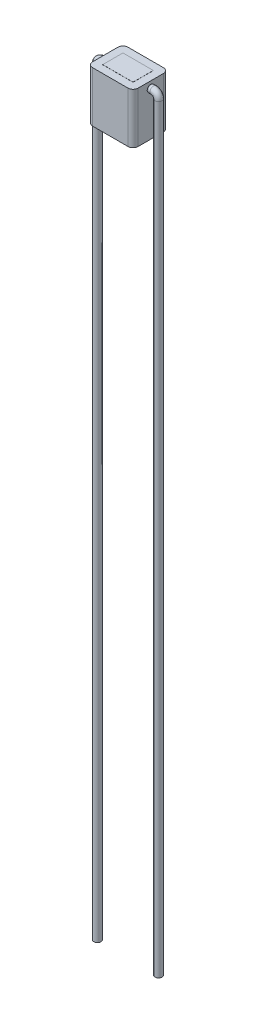
ISO-10303-21;
HEADER;
FILE_DESCRIPTION(('STEP AP214'),'2;1');
FILE_NAME('part.step','',(''),(''),'','','');
FILE_SCHEMA(('AUTOMOTIVE_DESIGN { 1 0 10303 214 1 1 1 1 }'));
ENDSEC;
DATA;
#1=APPLICATION_CONTEXT('core data for automotive mechanical design processes');
#2=APPLICATION_PROTOCOL_DEFINITION('international standard','automotive_design',2000,#1);
#3=PRODUCT_CONTEXT('',#1,'mechanical');
#4=PRODUCT('Part','Part','',(#3));
#5=PRODUCT_RELATED_PRODUCT_CATEGORY('part','',(#4));
#6=PRODUCT_DEFINITION_FORMATION('','',#4);
#7=PRODUCT_DEFINITION_CONTEXT('part definition',#1,'design');
#8=PRODUCT_DEFINITION('design','',#6,#7);
#9=PRODUCT_DEFINITION_SHAPE('','',#8);
#10=(LENGTH_UNIT() NAMED_UNIT(*) SI_UNIT(.MILLI.,.METRE.));
#11=(NAMED_UNIT(*) PLANE_ANGLE_UNIT() SI_UNIT($,.RADIAN.));
#12=(NAMED_UNIT(*) SI_UNIT($,.STERADIAN.) SOLID_ANGLE_UNIT());
#13=UNCERTAINTY_MEASURE_WITH_UNIT(LENGTH_MEASURE(1.E-05),#10,'distance_accuracy_value','');
#14=(GEOMETRIC_REPRESENTATION_CONTEXT(3) GLOBAL_UNCERTAINTY_ASSIGNED_CONTEXT((#13)) GLOBAL_UNIT_ASSIGNED_CONTEXT((#10,
#11,#12)) REPRESENTATION_CONTEXT('',''));
#15=CARTESIAN_POINT('',(0.,0.,0.));
#16=DIRECTION('',(0.,0.,1.));
#17=DIRECTION('',(1.,0.,0.));
#18=AXIS2_PLACEMENT_3D('',#15,#16,#17);
#19=CARTESIAN_POINT('',(2.25,5.,-1.75));
#20=DIRECTION('',(-1.,0.,0.));
#21=DIRECTION('',(0.,0.,1.));
#22=AXIS2_PLACEMENT_3D('',#19,#20,#21);
#23=PLANE('',#22);
#24=CARTESIAN_POINT('',(2.25,4.3537820782084,0.));
#25=DIRECTION('',(1.,0.,0.));
#26=DIRECTION('',(0.,0.,-1.));
#27=AXIS2_PLACEMENT_3D('',#24,#25,#26);
#28=CIRCLE('',#27,0.35);
#29=CARTESIAN_POINT('',(2.25,4.3537820782084,-0.35));
#30=VERTEX_POINT('',#29);
#31=EDGE_CURVE('E156',#30,#30,#28,.T.);
#32=ORIENTED_EDGE('',*,*,#31,.F.);
#33=EDGE_LOOP('',(#32));
#34=FACE_BOUND('',#33,.T.);
#35=DIRECTION('',(0.,0.,-1.));
#36=VECTOR('',#35,1.);
#37=CARTESIAN_POINT('',(2.25,5.,-1.75));
#38=LINE('',#37,#36);
#39=CARTESIAN_POINT('',(2.25,5.,1.25));
#40=VERTEX_POINT('',#39);
#41=CARTESIAN_POINT('',(2.25,5.,-1.25));
#42=VERTEX_POINT('',#41);
#43=EDGE_CURVE('E229',#40,#42,#38,.T.);
#44=ORIENTED_EDGE('',*,*,#43,.F.);
#45=DIRECTION('',(0.,-1.,0.));
#46=VECTOR('',#45,1.);
#47=CARTESIAN_POINT('',(2.25,5.,1.25));
#48=LINE('',#47,#46);
#49=CARTESIAN_POINT('',(2.25,0.,1.25));
#50=VERTEX_POINT('',#49);
#51=EDGE_CURVE('E263',#40,#50,#48,.T.);
#52=ORIENTED_EDGE('',*,*,#51,.T.);
#53=DIRECTION('',(0.,0.,-1.));
#54=VECTOR('',#53,1.);
#55=CARTESIAN_POINT('',(2.25,0.,-1.75));
#56=LINE('',#55,#54);
#57=CARTESIAN_POINT('',(2.25,0.,-1.25));
#58=VERTEX_POINT('',#57);
#59=EDGE_CURVE('E228',#50,#58,#56,.T.);
#60=ORIENTED_EDGE('',*,*,#59,.T.);
#61=DIRECTION('',(0.,-1.,0.));
#62=VECTOR('',#61,1.);
#63=CARTESIAN_POINT('',(2.25,5.,-1.25));
#64=LINE('',#63,#62);
#65=EDGE_CURVE('E261',#58,#42,#64,.F.);
#66=ORIENTED_EDGE('',*,*,#65,.T.);
#67=EDGE_LOOP('',(#44,#52,#60,#66));
#68=FACE_BOUND('',#67,.T.);
#69=ADVANCED_FACE('F34',(#34,#68),#23,.F.);
#70=CARTESIAN_POINT('',(-2.25,5.,-1.75));
#71=DIRECTION('',(0.,0.,1.));
#72=DIRECTION('',(1.,0.,0.));
#73=AXIS2_PLACEMENT_3D('',#70,#71,#72);
#74=PLANE('',#73);
#75=DIRECTION('',(-1.,0.,0.));
#76=VECTOR('',#75,1.);
#77=CARTESIAN_POINT('',(-2.25,0.,-1.75));
#78=LINE('',#77,#76);
#79=CARTESIAN_POINT('',(1.75,0.,-1.75));
#80=VERTEX_POINT('',#79);
#81=CARTESIAN_POINT('',(-1.75,0.,-1.75));
#82=VERTEX_POINT('',#81);
#83=EDGE_CURVE('E243',#80,#82,#78,.T.);
#84=ORIENTED_EDGE('',*,*,#83,.T.);
#85=DIRECTION('',(0.,-1.,0.));
#86=VECTOR('',#85,1.);
#87=CARTESIAN_POINT('',(-1.75,5.,-1.75));
#88=LINE('',#87,#86);
#89=CARTESIAN_POINT('',(-1.75,5.,-1.75));
#90=VERTEX_POINT('',#89);
#91=EDGE_CURVE('E11',#82,#90,#88,.F.);
#92=ORIENTED_EDGE('',*,*,#91,.T.);
#93=DIRECTION('',(-1.,0.,0.));
#94=VECTOR('',#93,1.);
#95=CARTESIAN_POINT('',(-2.25,5.,-1.75));
#96=LINE('',#95,#94);
#97=CARTESIAN_POINT('',(1.75,5.,-1.75));
#98=VERTEX_POINT('',#97);
#99=EDGE_CURVE('E232',#98,#90,#96,.T.);
#100=ORIENTED_EDGE('',*,*,#99,.F.);
#101=DIRECTION('',(0.,-1.,0.));
#102=VECTOR('',#101,1.);
#103=CARTESIAN_POINT('',(1.75,5.,-1.75));
#104=LINE('',#103,#102);
#105=EDGE_CURVE('E42',#98,#80,#104,.T.);
#106=ORIENTED_EDGE('',*,*,#105,.T.);
#107=EDGE_LOOP('',(#84,#92,#100,#106));
#108=FACE_BOUND('',#107,.T.);
#109=ADVANCED_FACE('F294',(#108),#74,.F.);
#110=CARTESIAN_POINT('',(-2.25,5.,-1.75));
#111=DIRECTION('',(1.,0.,0.));
#112=DIRECTION('',(0.,0.,-1.));
#113=AXIS2_PLACEMENT_3D('',#110,#111,#112);
#114=PLANE('',#113);
#115=CARTESIAN_POINT('',(-2.25,4.3537820782084,0.));
#116=DIRECTION('',(1.,0.,0.));
#117=DIRECTION('',(0.,0.,-1.));
#118=AXIS2_PLACEMENT_3D('',#115,#116,#117);
#119=CIRCLE('',#118,0.35);
#120=CARTESIAN_POINT('',(-2.25,4.3537820782084,-0.35));
#121=VERTEX_POINT('',#120);
#122=EDGE_CURVE('E644',#121,#121,#119,.F.);
#123=ORIENTED_EDGE('',*,*,#122,.F.);
#124=EDGE_LOOP('',(#123));
#125=FACE_BOUND('',#124,.T.);
#126=DIRECTION('',(0.,0.,1.));
#127=VECTOR('',#126,1.);
#128=CARTESIAN_POINT('',(-2.25,0.,-1.75));
#129=LINE('',#128,#127);
#130=CARTESIAN_POINT('',(-2.25,0.,-1.25));
#131=VERTEX_POINT('',#130);
#132=CARTESIAN_POINT('',(-2.25,0.,1.25));
#133=VERTEX_POINT('',#132);
#134=EDGE_CURVE('E246',#131,#133,#129,.T.);
#135=ORIENTED_EDGE('',*,*,#134,.T.);
#136=DIRECTION('',(0.,-1.,0.));
#137=VECTOR('',#136,1.);
#138=CARTESIAN_POINT('',(-2.25,5.,1.25));
#139=LINE('',#138,#137);
#140=CARTESIAN_POINT('',(-2.25,5.,1.25));
#141=VERTEX_POINT('',#140);
#142=EDGE_CURVE('E49',#133,#141,#139,.F.);
#143=ORIENTED_EDGE('',*,*,#142,.T.);
#144=DIRECTION('',(0.,0.,1.));
#145=VECTOR('',#144,1.);
#146=CARTESIAN_POINT('',(-2.25,5.,-1.75));
#147=LINE('',#146,#145);
#148=CARTESIAN_POINT('',(-2.25,5.,-1.25));
#149=VERTEX_POINT('',#148);
#150=EDGE_CURVE('E235',#149,#141,#147,.T.);
#151=ORIENTED_EDGE('',*,*,#150,.F.);
#152=DIRECTION('',(0.,-1.,0.));
#153=VECTOR('',#152,1.);
#154=CARTESIAN_POINT('',(-2.25,5.,-1.25));
#155=LINE('',#154,#153);
#156=EDGE_CURVE('E286',#149,#131,#155,.T.);
#157=ORIENTED_EDGE('',*,*,#156,.T.);
#158=EDGE_LOOP('',(#135,#143,#151,#157));
#159=FACE_BOUND('',#158,.T.);
#160=ADVANCED_FACE('F305',(#125,#159),#114,.F.);
#161=CARTESIAN_POINT('',(-2.25,5.,1.75));
#162=DIRECTION('',(0.,0.,-1.));
#163=DIRECTION('',(-1.,0.,0.));
#164=AXIS2_PLACEMENT_3D('',#161,#162,#163);
#165=PLANE('',#164);
#166=DIRECTION('',(1.,0.,0.));
#167=VECTOR('',#166,1.);
#168=CARTESIAN_POINT('',(-2.25,0.,1.75));
#169=LINE('',#168,#167);
#170=CARTESIAN_POINT('',(-1.75,0.,1.75));
#171=VERTEX_POINT('',#170);
#172=CARTESIAN_POINT('',(1.75,0.,1.75));
#173=VERTEX_POINT('',#172);
#174=EDGE_CURVE('E233',#171,#173,#169,.T.);
#175=ORIENTED_EDGE('',*,*,#174,.T.);
#176=DIRECTION('',(0.,-1.,0.));
#177=VECTOR('',#176,1.);
#178=CARTESIAN_POINT('',(1.75,5.,1.75));
#179=LINE('',#178,#177);
#180=CARTESIAN_POINT('',(1.75,5.,1.75));
#181=VERTEX_POINT('',#180);
#182=EDGE_CURVE('E277',#173,#181,#179,.F.);
#183=ORIENTED_EDGE('',*,*,#182,.T.);
#184=DIRECTION('',(1.,0.,0.));
#185=VECTOR('',#184,1.);
#186=CARTESIAN_POINT('',(-2.25,5.,1.75));
#187=LINE('',#186,#185);
#188=CARTESIAN_POINT('',(-1.75,5.,1.75));
#189=VERTEX_POINT('',#188);
#190=EDGE_CURVE('E237',#189,#181,#187,.T.);
#191=ORIENTED_EDGE('',*,*,#190,.F.);
#192=DIRECTION('',(0.,-1.,0.));
#193=VECTOR('',#192,1.);
#194=CARTESIAN_POINT('',(-1.75,5.,1.75));
#195=LINE('',#194,#193);
#196=EDGE_CURVE('E274',#189,#171,#195,.T.);
#197=ORIENTED_EDGE('',*,*,#196,.T.);
#198=EDGE_LOOP('',(#175,#183,#191,#197));
#199=FACE_BOUND('',#198,.T.);
#200=ADVANCED_FACE('F314',(#199),#165,.F.);
#201=CARTESIAN_POINT('',(0.,5.,0.));
#202=DIRECTION('',(0.,1.,0.));
#203=DIRECTION('',(0.,0.,1.));
#204=AXIS2_PLACEMENT_3D('',#201,#202,#203);
#205=PLANE('',#204);
#206=DIRECTION('',(0.,0.,-1.));
#207=VECTOR('',#206,1.);
#208=CARTESIAN_POINT('',(1.5,5.,0.));
#209=LINE('',#208,#207);
#210=CARTESIAN_POINT('',(1.5,5.,1.));
#211=VERTEX_POINT('',#210);
#212=CARTESIAN_POINT('',(1.5,5.,-1.));
#213=VERTEX_POINT('',#212);
#214=EDGE_CURVE('E225',#211,#213,#209,.T.);
#215=ORIENTED_EDGE('',*,*,#214,.F.);
#216=DIRECTION('',(1.,0.,0.));
#217=VECTOR('',#216,1.);
#218=CARTESIAN_POINT('',(0.,5.,1.));
#219=LINE('',#218,#217);
#220=CARTESIAN_POINT('',(-1.5,5.,1.));
#221=VERTEX_POINT('',#220);
#222=EDGE_CURVE('E222',#221,#211,#219,.T.);
#223=ORIENTED_EDGE('',*,*,#222,.F.);
#224=DIRECTION('',(0.,0.,1.));
#225=VECTOR('',#224,1.);
#226=CARTESIAN_POINT('',(-1.5,5.,0.));
#227=LINE('',#226,#225);
#228=CARTESIAN_POINT('',(-1.5,5.,-1.));
#229=VERTEX_POINT('',#228);
#230=EDGE_CURVE('E219',#229,#221,#227,.T.);
#231=ORIENTED_EDGE('',*,*,#230,.F.);
#232=DIRECTION('',(-1.,0.,0.));
#233=VECTOR('',#232,1.);
#234=CARTESIAN_POINT('',(0.,5.,-1.));
#235=LINE('',#234,#233);
#236=EDGE_CURVE('E205',#213,#229,#235,.T.);
#237=ORIENTED_EDGE('',*,*,#236,.F.);
#238=EDGE_LOOP('',(#215,#223,#231,#237));
#239=FACE_BOUND('',#238,.T.);
#240=ORIENTED_EDGE('',*,*,#190,.T.);
#241=CARTESIAN_POINT('',(1.75,5.,1.25));
#242=DIRECTION('',(0.,1.,0.));
#243=DIRECTION('',(0.,0.,1.));
#244=AXIS2_PLACEMENT_3D('',#241,#242,#243);
#245=CIRCLE('',#244,0.5);
#246=EDGE_CURVE('E284',#181,#40,#245,.T.);
#247=ORIENTED_EDGE('',*,*,#246,.T.);
#248=ORIENTED_EDGE('',*,*,#43,.T.);
#249=CARTESIAN_POINT('',(1.75,5.,-1.25));
#250=DIRECTION('',(0.,1.,0.));
#251=DIRECTION('',(0.,0.,1.));
#252=AXIS2_PLACEMENT_3D('',#249,#250,#251);
#253=CIRCLE('',#252,0.5);
#254=EDGE_CURVE('E279',#42,#98,#253,.T.);
#255=ORIENTED_EDGE('',*,*,#254,.T.);
#256=ORIENTED_EDGE('',*,*,#99,.T.);
#257=CARTESIAN_POINT('',(-1.75,5.,-1.25));
#258=DIRECTION('',(0.,1.,0.));
#259=DIRECTION('',(0.,0.,1.));
#260=AXIS2_PLACEMENT_3D('',#257,#258,#259);
#261=CIRCLE('',#260,0.5);
#262=EDGE_CURVE('E56',#90,#149,#261,.T.);
#263=ORIENTED_EDGE('',*,*,#262,.T.);
#264=ORIENTED_EDGE('',*,*,#150,.T.);
#265=CARTESIAN_POINT('',(-1.75,5.,1.25));
#266=DIRECTION('',(0.,1.,0.));
#267=DIRECTION('',(0.,0.,1.));
#268=AXIS2_PLACEMENT_3D('',#265,#266,#267);
#269=CIRCLE('',#268,0.5);
#270=EDGE_CURVE('E282',#141,#189,#269,.T.);
#271=ORIENTED_EDGE('',*,*,#270,.T.);
#272=EDGE_LOOP('',(#240,#247,#248,#255,#256,#263,#264,#271));
#273=FACE_BOUND('',#272,.T.);
#274=ADVANCED_FACE('F307',(#239,#273),#205,.T.);
#275=CARTESIAN_POINT('',(0.,0.,0.));
#276=DIRECTION('',(0.,1.,0.));
#277=DIRECTION('',(0.,0.,1.));
#278=AXIS2_PLACEMENT_3D('',#275,#276,#277);
#279=PLANE('',#278);
#280=DIRECTION('',(1.,0.,0.));
#281=VECTOR('',#280,1.);
#282=CARTESIAN_POINT('',(0.,0.,1.));
#283=LINE('',#282,#281);
#284=CARTESIAN_POINT('',(-1.5,0.,1.));
#285=VERTEX_POINT('',#284);
#286=CARTESIAN_POINT('',(1.5,0.,1.));
#287=VERTEX_POINT('',#286);
#288=EDGE_CURVE('E255',#285,#287,#283,.T.);
#289=ORIENTED_EDGE('',*,*,#288,.T.);
#290=DIRECTION('',(0.,0.,-1.));
#291=VECTOR('',#290,1.);
#292=CARTESIAN_POINT('',(1.5,0.,0.));
#293=LINE('',#292,#291);
#294=CARTESIAN_POINT('',(1.5,0.,-1.));
#295=VERTEX_POINT('',#294);
#296=EDGE_CURVE('E258',#287,#295,#293,.T.);
#297=ORIENTED_EDGE('',*,*,#296,.T.);
#298=DIRECTION('',(-1.,0.,0.));
#299=VECTOR('',#298,1.);
#300=CARTESIAN_POINT('',(0.,0.,-1.));
#301=LINE('',#300,#299);
#302=CARTESIAN_POINT('',(-1.5,0.,-1.));
#303=VERTEX_POINT('',#302);
#304=EDGE_CURVE('E240',#295,#303,#301,.T.);
#305=ORIENTED_EDGE('',*,*,#304,.T.);
#306=DIRECTION('',(0.,0.,1.));
#307=VECTOR('',#306,1.);
#308=CARTESIAN_POINT('',(-1.5,0.,0.));
#309=LINE('',#308,#307);
#310=EDGE_CURVE('E252',#303,#285,#309,.T.);
#311=ORIENTED_EDGE('',*,*,#310,.T.);
#312=EDGE_LOOP('',(#289,#297,#305,#311));
#313=FACE_BOUND('',#312,.T.);
#314=ORIENTED_EDGE('',*,*,#59,.F.);
#315=CARTESIAN_POINT('',(1.75,0.,1.25));
#316=DIRECTION('',(0.,1.,0.));
#317=DIRECTION('',(0.,0.,1.));
#318=AXIS2_PLACEMENT_3D('',#315,#316,#317);
#319=CIRCLE('',#318,0.5);
#320=EDGE_CURVE('E272',#50,#173,#319,.F.);
#321=ORIENTED_EDGE('',*,*,#320,.T.);
#322=ORIENTED_EDGE('',*,*,#174,.F.);
#323=CARTESIAN_POINT('',(-1.75,0.,1.25));
#324=DIRECTION('',(0.,1.,0.));
#325=DIRECTION('',(0.,0.,1.));
#326=AXIS2_PLACEMENT_3D('',#323,#324,#325);
#327=CIRCLE('',#326,0.5);
#328=EDGE_CURVE('E270',#171,#133,#327,.F.);
#329=ORIENTED_EDGE('',*,*,#328,.T.);
#330=ORIENTED_EDGE('',*,*,#134,.F.);
#331=CARTESIAN_POINT('',(-1.75,0.,-1.25));
#332=DIRECTION('',(0.,1.,0.));
#333=DIRECTION('',(0.,0.,1.));
#334=AXIS2_PLACEMENT_3D('',#331,#332,#333);
#335=CIRCLE('',#334,0.5);
#336=EDGE_CURVE('E268',#131,#82,#335,.F.);
#337=ORIENTED_EDGE('',*,*,#336,.T.);
#338=ORIENTED_EDGE('',*,*,#83,.F.);
#339=CARTESIAN_POINT('',(1.75,0.,-1.25));
#340=DIRECTION('',(0.,1.,0.));
#341=DIRECTION('',(0.,0.,1.));
#342=AXIS2_PLACEMENT_3D('',#339,#340,#341);
#343=CIRCLE('',#342,0.5);
#344=EDGE_CURVE('E266',#80,#58,#343,.F.);
#345=ORIENTED_EDGE('',*,*,#344,.T.);
#346=EDGE_LOOP('',(#314,#321,#322,#329,#330,#337,#338,#345));
#347=FACE_BOUND('',#346,.T.);
#348=ADVANCED_FACE('F300',(#313,#347),#279,.F.);
#349=CARTESIAN_POINT('',(0.,-0.01,0.));
#350=DIRECTION('',(0.,1.,0.));
#351=DIRECTION('',(0.,0.,1.));
#352=AXIS2_PLACEMENT_3D('',#349,#350,#351);
#353=PLANE('',#352);
#354=DIRECTION('',(0.,0.,-1.));
#355=VECTOR('',#354,1.);
#356=CARTESIAN_POINT('',(1.5,-0.01,-1.));
#357=LINE('',#356,#355);
#358=CARTESIAN_POINT('',(1.5,-0.01,1.));
#359=VERTEX_POINT('',#358);
#360=CARTESIAN_POINT('',(1.5,-0.01,-1.));
#361=VERTEX_POINT('',#360);
#362=EDGE_CURVE('E189',#359,#361,#357,.T.);
#363=ORIENTED_EDGE('',*,*,#362,.F.);
#364=DIRECTION('',(1.,0.,0.));
#365=VECTOR('',#364,1.);
#366=CARTESIAN_POINT('',(-1.5,-0.01,1.));
#367=LINE('',#366,#365);
#368=CARTESIAN_POINT('',(-1.5,-0.01,1.));
#369=VERTEX_POINT('',#368);
#370=EDGE_CURVE('E198',#369,#359,#367,.T.);
#371=ORIENTED_EDGE('',*,*,#370,.F.);
#372=DIRECTION('',(0.,0.,1.));
#373=VECTOR('',#372,1.);
#374=CARTESIAN_POINT('',(-1.5,-0.01,-1.));
#375=LINE('',#374,#373);
#376=CARTESIAN_POINT('',(-1.5,-0.01,-1.));
#377=VERTEX_POINT('',#376);
#378=EDGE_CURVE('E195',#377,#369,#375,.T.);
#379=ORIENTED_EDGE('',*,*,#378,.F.);
#380=DIRECTION('',(-1.,0.,0.));
#381=VECTOR('',#380,1.);
#382=CARTESIAN_POINT('',(-1.5,-0.01,-1.));
#383=LINE('',#382,#381);
#384=EDGE_CURVE('E192',#361,#377,#383,.T.);
#385=ORIENTED_EDGE('',*,*,#384,.F.);
#386=EDGE_LOOP('',(#363,#371,#379,#385));
#387=FACE_BOUND('',#386,.T.);
#388=ADVANCED_FACE('F488',(#387),#353,.F.);
#389=CARTESIAN_POINT('',(-1.5,-0.01,-1.));
#390=DIRECTION('',(0.,0.,-1.));
#391=DIRECTION('',(-1.,0.,0.));
#392=AXIS2_PLACEMENT_3D('',#389,#390,#391);
#393=PLANE('',#392);
#394=ORIENTED_EDGE('',*,*,#304,.F.);
#395=DIRECTION('',(0.,1.,0.));
#396=VECTOR('',#395,1.);
#397=CARTESIAN_POINT('',(1.5,-0.01,-1.));
#398=LINE('',#397,#396);
#399=EDGE_CURVE('E214',#361,#295,#398,.T.);
#400=ORIENTED_EDGE('',*,*,#399,.F.);
#401=ORIENTED_EDGE('',*,*,#384,.T.);
#402=DIRECTION('',(0.,1.,0.));
#403=VECTOR('',#402,1.);
#404=CARTESIAN_POINT('',(-1.5,-0.01,-1.));
#405=LINE('',#404,#403);
#406=EDGE_CURVE('E211',#377,#303,#405,.T.);
#407=ORIENTED_EDGE('',*,*,#406,.T.);
#408=EDGE_LOOP('',(#394,#400,#401,#407));
#409=FACE_BOUND('',#408,.T.);
#410=ADVANCED_FACE('F491',(#409),#393,.T.);
#411=CARTESIAN_POINT('',(-1.5,-0.01,-1.));
#412=DIRECTION('',(-1.,0.,0.));
#413=DIRECTION('',(0.,0.,1.));
#414=AXIS2_PLACEMENT_3D('',#411,#412,#413);
#415=PLANE('',#414);
#416=ORIENTED_EDGE('',*,*,#310,.F.);
#417=ORIENTED_EDGE('',*,*,#406,.F.);
#418=ORIENTED_EDGE('',*,*,#378,.T.);
#419=DIRECTION('',(0.,1.,0.));
#420=VECTOR('',#419,1.);
#421=CARTESIAN_POINT('',(-1.5,-0.01,1.));
#422=LINE('',#421,#420);
#423=EDGE_CURVE('E207',#369,#285,#422,.T.);
#424=ORIENTED_EDGE('',*,*,#423,.T.);
#425=EDGE_LOOP('',(#416,#417,#418,#424));
#426=FACE_BOUND('',#425,.T.);
#427=ADVANCED_FACE('F503',(#426),#415,.T.);
#428=CARTESIAN_POINT('',(-1.5,-0.01,1.));
#429=DIRECTION('',(0.,0.,1.));
#430=DIRECTION('',(1.,0.,0.));
#431=AXIS2_PLACEMENT_3D('',#428,#429,#430);
#432=PLANE('',#431);
#433=ORIENTED_EDGE('',*,*,#288,.F.);
#434=ORIENTED_EDGE('',*,*,#423,.F.);
#435=ORIENTED_EDGE('',*,*,#370,.T.);
#436=DIRECTION('',(0.,1.,0.));
#437=VECTOR('',#436,1.);
#438=CARTESIAN_POINT('',(1.5,-0.01,1.));
#439=LINE('',#438,#437);
#440=EDGE_CURVE('E202',#359,#287,#439,.T.);
#441=ORIENTED_EDGE('',*,*,#440,.T.);
#442=EDGE_LOOP('',(#433,#434,#435,#441));
#443=FACE_BOUND('',#442,.T.);
#444=ADVANCED_FACE('F499',(#443),#432,.T.);
#445=CARTESIAN_POINT('',(1.5,-0.01,-1.));
#446=DIRECTION('',(1.,0.,0.));
#447=DIRECTION('',(0.,0.,-1.));
#448=AXIS2_PLACEMENT_3D('',#445,#446,#447);
#449=PLANE('',#448);
#450=ORIENTED_EDGE('',*,*,#296,.F.);
#451=ORIENTED_EDGE('',*,*,#440,.F.);
#452=ORIENTED_EDGE('',*,*,#362,.T.);
#453=ORIENTED_EDGE('',*,*,#399,.T.);
#454=EDGE_LOOP('',(#450,#451,#452,#453));
#455=FACE_BOUND('',#454,.T.);
#456=ADVANCED_FACE('F509',(#455),#449,.T.);
#457=CARTESIAN_POINT('',(1.5,5.01,1.));
#458=VERTEX_POINT('',#457);
#459=EDGE_CURVE('E206',#211,#458,#439,.T.);
#460=ORIENTED_EDGE('',*,*,#459,.F.);
#461=ORIENTED_EDGE('',*,*,#214,.T.);
#462=CARTESIAN_POINT('',(1.5,5.01,-1.));
#463=VERTEX_POINT('',#462);
#464=EDGE_CURVE('E201',#213,#463,#398,.T.);
#465=ORIENTED_EDGE('',*,*,#464,.T.);
#466=DIRECTION('',(0.,0.,-1.));
#467=VECTOR('',#466,1.);
#468=CARTESIAN_POINT('',(1.5,5.01,-1.));
#469=LINE('',#468,#467);
#470=EDGE_CURVE('E177',#458,#463,#469,.T.);
#471=ORIENTED_EDGE('',*,*,#470,.F.);
#472=EDGE_LOOP('',(#460,#461,#465,#471));
#473=FACE_BOUND('',#472,.T.);
#474=ADVANCED_FACE('F497',(#473),#449,.T.);
#475=CARTESIAN_POINT('',(-1.5,5.01,1.));
#476=VERTEX_POINT('',#475);
#477=EDGE_CURVE('E210',#221,#476,#422,.T.);
#478=ORIENTED_EDGE('',*,*,#477,.F.);
#479=ORIENTED_EDGE('',*,*,#222,.T.);
#480=ORIENTED_EDGE('',*,*,#459,.T.);
#481=DIRECTION('',(1.,0.,0.));
#482=VECTOR('',#481,1.);
#483=CARTESIAN_POINT('',(-1.5,5.01,1.));
#484=LINE('',#483,#482);
#485=EDGE_CURVE('E186',#476,#458,#484,.T.);
#486=ORIENTED_EDGE('',*,*,#485,.F.);
#487=EDGE_LOOP('',(#478,#479,#480,#486));
#488=FACE_BOUND('',#487,.T.);
#489=ADVANCED_FACE('F493',(#488),#432,.T.);
#490=CARTESIAN_POINT('',(-1.5,5.01,-1.));
#491=VERTEX_POINT('',#490);
#492=EDGE_CURVE('E213',#229,#491,#405,.T.);
#493=ORIENTED_EDGE('',*,*,#492,.F.);
#494=ORIENTED_EDGE('',*,*,#230,.T.);
#495=ORIENTED_EDGE('',*,*,#477,.T.);
#496=DIRECTION('',(0.,0.,1.));
#497=VECTOR('',#496,1.);
#498=CARTESIAN_POINT('',(-1.5,5.01,-1.));
#499=LINE('',#498,#497);
#500=EDGE_CURVE('E183',#491,#476,#499,.T.);
#501=ORIENTED_EDGE('',*,*,#500,.F.);
#502=EDGE_LOOP('',(#493,#494,#495,#501));
#503=FACE_BOUND('',#502,.T.);
#504=ADVANCED_FACE('F496',(#503),#415,.T.);
#505=ORIENTED_EDGE('',*,*,#464,.F.);
#506=ORIENTED_EDGE('',*,*,#236,.T.);
#507=ORIENTED_EDGE('',*,*,#492,.T.);
#508=DIRECTION('',(-1.,0.,0.));
#509=VECTOR('',#508,1.);
#510=CARTESIAN_POINT('',(-1.5,5.01,-1.));
#511=LINE('',#510,#509);
#512=EDGE_CURVE('E180',#463,#491,#511,.T.);
#513=ORIENTED_EDGE('',*,*,#512,.F.);
#514=EDGE_LOOP('',(#505,#506,#507,#513));
#515=FACE_BOUND('',#514,.T.);
#516=ADVANCED_FACE('F486',(#515),#393,.T.);
#517=CARTESIAN_POINT('',(0.,5.01,0.));
#518=DIRECTION('',(0.,1.,0.));
#519=DIRECTION('',(0.,0.,1.));
#520=AXIS2_PLACEMENT_3D('',#517,#518,#519);
#521=PLANE('',#520);
#522=ORIENTED_EDGE('',*,*,#470,.T.);
#523=ORIENTED_EDGE('',*,*,#512,.T.);
#524=ORIENTED_EDGE('',*,*,#500,.T.);
#525=ORIENTED_EDGE('',*,*,#485,.T.);
#526=EDGE_LOOP('',(#522,#523,#524,#525));
#527=FACE_BOUND('',#526,.T.);
#528=ADVANCED_FACE('F350',(#527),#521,.T.);
#529=CARTESIAN_POINT('',(1.75,5.,1.25));
#530=DIRECTION('',(0.,-1.,0.));
#531=DIRECTION('',(0.,0.,-1.));
#532=AXIS2_PLACEMENT_3D('',#529,#530,#531);
#533=CYLINDRICAL_SURFACE('',#532,0.5);
#534=ORIENTED_EDGE('',*,*,#246,.F.);
#535=ORIENTED_EDGE('',*,*,#182,.F.);
#536=ORIENTED_EDGE('',*,*,#320,.F.);
#537=ORIENTED_EDGE('',*,*,#51,.F.);
#538=EDGE_LOOP('',(#534,#535,#536,#537));
#539=FACE_BOUND('',#538,.T.);
#540=ADVANCED_FACE('F319',(#539),#533,.T.);
#541=CARTESIAN_POINT('',(-1.75,5.,1.25));
#542=DIRECTION('',(0.,-1.,0.));
#543=DIRECTION('',(0.,0.,-1.));
#544=AXIS2_PLACEMENT_3D('',#541,#542,#543);
#545=CYLINDRICAL_SURFACE('',#544,0.5);
#546=ORIENTED_EDGE('',*,*,#270,.F.);
#547=ORIENTED_EDGE('',*,*,#142,.F.);
#548=ORIENTED_EDGE('',*,*,#328,.F.);
#549=ORIENTED_EDGE('',*,*,#196,.F.);
#550=EDGE_LOOP('',(#546,#547,#548,#549));
#551=FACE_BOUND('',#550,.T.);
#552=ADVANCED_FACE('F311',(#551),#545,.T.);
#553=CARTESIAN_POINT('',(-1.75,5.,-1.25));
#554=DIRECTION('',(0.,-1.,0.));
#555=DIRECTION('',(0.,0.,-1.));
#556=AXIS2_PLACEMENT_3D('',#553,#554,#555);
#557=CYLINDRICAL_SURFACE('',#556,0.5);
#558=ORIENTED_EDGE('',*,*,#262,.F.);
#559=ORIENTED_EDGE('',*,*,#91,.F.);
#560=ORIENTED_EDGE('',*,*,#336,.F.);
#561=ORIENTED_EDGE('',*,*,#156,.F.);
#562=EDGE_LOOP('',(#558,#559,#560,#561));
#563=FACE_BOUND('',#562,.T.);
#564=ADVANCED_FACE('F304',(#563),#557,.T.);
#565=CARTESIAN_POINT('',(1.75,5.,-1.25));
#566=DIRECTION('',(0.,-1.,0.));
#567=DIRECTION('',(0.,0.,-1.));
#568=AXIS2_PLACEMENT_3D('',#565,#566,#567);
#569=CYLINDRICAL_SURFACE('',#568,0.5);
#570=ORIENTED_EDGE('',*,*,#254,.F.);
#571=ORIENTED_EDGE('',*,*,#65,.F.);
#572=ORIENTED_EDGE('',*,*,#344,.F.);
#573=ORIENTED_EDGE('',*,*,#105,.F.);
#574=EDGE_LOOP('',(#570,#571,#572,#573));
#575=FACE_BOUND('',#574,.T.);
#576=ADVANCED_FACE('F36',(#575),#569,.T.);
#577=CARTESIAN_POINT('',(3.02591837528372,-71.1462179217916,0.));
#578=DIRECTION('',(0.,-1.,0.));
#579=DIRECTION('',(0.,0.,-1.));
#580=AXIS2_PLACEMENT_3D('',#577,#578,#579);
#581=PLANE('',#580);
#582=CARTESIAN_POINT('',(3.02591837528372,-71.1462179217916,0.));
#583=DIRECTION('',(0.,-1.,0.));
#584=DIRECTION('',(0.,0.,-1.));
#585=AXIS2_PLACEMENT_3D('',#582,#583,#584);
#586=CIRCLE('',#585,0.35);
#587=CARTESIAN_POINT('',(3.02591837528372,-71.1462179217916,-0.35));
#588=VERTEX_POINT('',#587);
#589=EDGE_CURVE('E175',#588,#588,#586,.T.);
#590=ORIENTED_EDGE('',*,*,#589,.T.);
#591=EDGE_LOOP('',(#590));
#592=FACE_BOUND('',#591,.T.);
#593=ADVANCED_FACE('F324',(#592),#581,.T.);
#594=CARTESIAN_POINT('',(2.25,4.3537820782084,0.));
#595=DIRECTION('',(1.,0.,0.));
#596=DIRECTION('',(0.,0.,-1.));
#597=AXIS2_PLACEMENT_3D('',#594,#595,#596);
#598=CYLINDRICAL_SURFACE('',#597,0.35);
#599=CARTESIAN_POINT('',(2.3,4.3537820782084,0.));
#600=DIRECTION('',(1.,0.,0.));
#601=DIRECTION('',(0.,0.,-1.));
#602=AXIS2_PLACEMENT_3D('',#599,#600,#601);
#603=CIRCLE('',#602,0.35);
#604=CARTESIAN_POINT('',(2.3,4.3537820782084,-0.35));
#605=VERTEX_POINT('',#604);
#606=EDGE_CURVE('E160',#605,#605,#603,.T.);
#607=ORIENTED_EDGE('',*,*,#606,.F.);
#608=EDGE_LOOP('',(#607));
#609=FACE_BOUND('',#608,.T.);
#610=ORIENTED_EDGE('',*,*,#31,.T.);
#611=EDGE_LOOP('',(#610));
#612=FACE_BOUND('',#611,.T.);
#613=ADVANCED_FACE('F330',(#609,#612),#598,.T.);
#614=CARTESIAN_POINT('',(2.3,4.3537820782084,0.));
#615=DIRECTION('',(1.,0.,0.));
#616=DIRECTION('',(0.,0.,-1.));
#617=AXIS2_PLACEMENT_3D('',#614,#615,#616);
#618=CYLINDRICAL_SURFACE('',#617,0.35);
#619=CARTESIAN_POINT('',(2.52591837528371,4.3537820782084,0.));
#620=DIRECTION('',(1.,0.,0.));
#621=DIRECTION('',(0.,0.,-1.));
#622=AXIS2_PLACEMENT_3D('',#619,#620,#621);
#623=CIRCLE('',#622,0.35);
#624=CARTESIAN_POINT('',(2.52591837528371,4.70378207820839,0.));
#625=VERTEX_POINT('',#624);
#626=EDGE_CURVE('E169',#625,#625,#623,.T.);
#627=ORIENTED_EDGE('',*,*,#626,.F.);
#628=EDGE_LOOP('',(#627));
#629=FACE_BOUND('',#628,.T.);
#630=ORIENTED_EDGE('',*,*,#606,.T.);
#631=EDGE_LOOP('',(#630));
#632=FACE_BOUND('',#631,.T.);
#633=ADVANCED_FACE('F386',(#629,#632),#618,.T.);
#634=CARTESIAN_POINT('',(2.52591837528371,3.8537820782084,0.));
#635=DIRECTION('',(0.,0.,-1.));
#636=DIRECTION('',(-1.,0.,0.));
#637=AXIS2_PLACEMENT_3D('',#634,#635,#636);
#638=TOROIDAL_SURFACE('',#637,0.5,0.35);
#639=CARTESIAN_POINT('',(3.02591837528371,3.8537820782084,0.));
#640=DIRECTION('',(0.,-1.,0.));
#641=DIRECTION('',(0.,0.,-1.));
#642=AXIS2_PLACEMENT_3D('',#639,#640,#641);
#643=CIRCLE('',#642,0.35);
#644=CARTESIAN_POINT('',(3.37591837528371,3.8537820782084,0.));
#645=VERTEX_POINT('',#644);
#646=EDGE_CURVE('E172',#645,#645,#643,.T.);
#647=CARTESIAN_POINT('',(2.52591837528371,3.8537820782084,0.));
#648=DIRECTION('',(0.,0.,-1.));
#649=DIRECTION('',(-1.,0.,0.));
#650=AXIS2_PLACEMENT_3D('',#647,#648,#649);
#651=CIRCLE('',#650,0.85);
#652=EDGE_CURVE('',#625,#645,#651,.T.);
#653=ORIENTED_EDGE('',*,*,#626,.T.);
#654=ORIENTED_EDGE('',*,*,#646,.F.);
#655=ORIENTED_EDGE('',*,*,#652,.T.);
#656=ORIENTED_EDGE('',*,*,#652,.F.);
#657=EDGE_LOOP('',(#653,#655,#654,#656));
#658=FACE_BOUND('',#657,.T.);
#659=ADVANCED_FACE('F335',(#658),#638,.T.);
#660=CARTESIAN_POINT('',(3.02591837528371,3.8537820782084,0.));
#661=DIRECTION('',(0.,-1.,0.));
#662=DIRECTION('',(1.,0.,0.));
#663=AXIS2_PLACEMENT_3D('',#660,#661,#662);
#664=CYLINDRICAL_SURFACE('',#663,0.35);
#665=ORIENTED_EDGE('',*,*,#589,.F.);
#666=EDGE_LOOP('',(#665));
#667=FACE_BOUND('',#666,.T.);
#668=ORIENTED_EDGE('',*,*,#646,.T.);
#669=EDGE_LOOP('',(#668));
#670=FACE_BOUND('',#669,.T.);
#671=ADVANCED_FACE('F325',(#667,#670),#664,.T.);
#672=CARTESIAN_POINT('',(-3.02591837528372,-71.1462179217916,0.));
#673=DIRECTION('',(0.,-1.,0.));
#674=DIRECTION('',(0.,0.,-1.));
#675=AXIS2_PLACEMENT_3D('',#672,#673,#674);
#676=PLANE('',#675);
#677=CARTESIAN_POINT('',(-3.02591837528372,-71.1462179217916,0.));
#678=DIRECTION('',(0.,1.,0.));
#679=DIRECTION('',(0.,0.,-1.));
#680=AXIS2_PLACEMENT_3D('',#677,#678,#679);
#681=CIRCLE('',#680,0.35);
#682=CARTESIAN_POINT('',(-3.02591837528372,-71.1462179217916,-0.35));
#683=VERTEX_POINT('',#682);
#684=EDGE_CURVE('E153',#683,#683,#681,.F.);
#685=ORIENTED_EDGE('',*,*,#684,.T.);
#686=EDGE_LOOP('',(#685));
#687=FACE_BOUND('',#686,.T.);
#688=ADVANCED_FACE('F154',(#687),#676,.T.);
#689=CARTESIAN_POINT('',(-2.25,4.3537820782084,0.));
#690=DIRECTION('',(-1.,0.,0.));
#691=DIRECTION('',(0.,0.,1.));
#692=AXIS2_PLACEMENT_3D('',#689,#690,#691);
#693=CYLINDRICAL_SURFACE('',#692,0.35);
#694=CARTESIAN_POINT('',(-2.3,4.3537820782084,0.));
#695=DIRECTION('',(1.,0.,0.));
#696=DIRECTION('',(0.,0.,-1.));
#697=AXIS2_PLACEMENT_3D('',#694,#695,#696);
#698=CIRCLE('',#697,0.35);
#699=CARTESIAN_POINT('',(-2.3,4.3537820782084,-0.35));
#700=VERTEX_POINT('',#699);
#701=EDGE_CURVE('E642',#700,#700,#698,.F.);
#702=ORIENTED_EDGE('',*,*,#701,.F.);
#703=EDGE_LOOP('',(#702));
#704=FACE_BOUND('',#703,.T.);
#705=ORIENTED_EDGE('',*,*,#122,.T.);
#706=EDGE_LOOP('',(#705));
#707=FACE_BOUND('',#706,.T.);
#708=ADVANCED_FACE('F434',(#704,#707),#693,.T.);
#709=CARTESIAN_POINT('',(-2.3,4.3537820782084,0.));
#710=DIRECTION('',(-1.,0.,0.));
#711=DIRECTION('',(0.,0.,1.));
#712=AXIS2_PLACEMENT_3D('',#709,#710,#711);
#713=CYLINDRICAL_SURFACE('',#712,0.35);
#714=CARTESIAN_POINT('',(-2.52591837528371,4.3537820782084,0.));
#715=DIRECTION('',(1.,0.,0.));
#716=DIRECTION('',(0.,0.,-1.));
#717=AXIS2_PLACEMENT_3D('',#714,#715,#716);
#718=CIRCLE('',#717,0.35);
#719=CARTESIAN_POINT('',(-2.52591837528371,4.70378207820839,0.));
#720=VERTEX_POINT('',#719);
#721=EDGE_CURVE('E163',#720,#720,#718,.F.);
#722=ORIENTED_EDGE('',*,*,#721,.F.);
#723=EDGE_LOOP('',(#722));
#724=FACE_BOUND('',#723,.T.);
#725=ORIENTED_EDGE('',*,*,#701,.T.);
#726=EDGE_LOOP('',(#725));
#727=FACE_BOUND('',#726,.T.);
#728=ADVANCED_FACE('F444',(#724,#727),#713,.T.);
#729=CARTESIAN_POINT('',(-2.52591837528371,3.8537820782084,0.));
#730=DIRECTION('',(0.,0.,1.));
#731=DIRECTION('',(1.,0.,0.));
#732=AXIS2_PLACEMENT_3D('',#729,#730,#731);
#733=TOROIDAL_SURFACE('',#732,0.5,0.35);
#734=CARTESIAN_POINT('',(-3.02591837528371,3.8537820782084,0.));
#735=DIRECTION('',(0.,1.,0.));
#736=DIRECTION('',(0.,0.,-1.));
#737=AXIS2_PLACEMENT_3D('',#734,#735,#736);
#738=CIRCLE('',#737,0.35);
#739=CARTESIAN_POINT('',(-3.37591837528371,3.8537820782084,0.));
#740=VERTEX_POINT('',#739);
#741=EDGE_CURVE('E157',#740,#740,#738,.F.);
#742=CARTESIAN_POINT('',(-2.52591837528371,3.8537820782084,0.));
#743=DIRECTION('',(0.,0.,1.));
#744=DIRECTION('',(1.,0.,0.));
#745=AXIS2_PLACEMENT_3D('',#742,#743,#744);
#746=CIRCLE('',#745,0.85);
#747=EDGE_CURVE('',#720,#740,#746,.T.);
#748=ORIENTED_EDGE('',*,*,#721,.T.);
#749=ORIENTED_EDGE('',*,*,#741,.F.);
#750=ORIENTED_EDGE('',*,*,#747,.T.);
#751=ORIENTED_EDGE('',*,*,#747,.F.);
#752=EDGE_LOOP('',(#748,#750,#749,#751));
#753=FACE_BOUND('',#752,.T.);
#754=ADVANCED_FACE('F457',(#753),#733,.T.);
#755=CARTESIAN_POINT('',(-3.02591837528371,3.8537820782084,0.));
#756=DIRECTION('',(0.,-1.,0.));
#757=DIRECTION('',(1.,0.,0.));
#758=AXIS2_PLACEMENT_3D('',#755,#756,#757);
#759=CYLINDRICAL_SURFACE('',#758,0.35);
#760=ORIENTED_EDGE('',*,*,#684,.F.);
#761=EDGE_LOOP('',(#760));
#762=FACE_BOUND('',#761,.T.);
#763=ORIENTED_EDGE('',*,*,#741,.T.);
#764=EDGE_LOOP('',(#763));
#765=FACE_BOUND('',#764,.T.);
#766=ADVANCED_FACE('F333',(#762,#765),#759,.T.);
#767=CLOSED_SHELL('',(#69,#109,#160,#200,#274,#348,#388,#410,#427,#444,#456,#474,#489,#504,#516,
#528,#540,#552,#564,#576,#593,#613,#633,#659,#671,#688,#708,#728,#754,#766));
#768=MANIFOLD_SOLID_BREP('B2',#767);
#769=ADVANCED_BREP_SHAPE_REPRESENTATION('',(#18,#768),#14);
#770=SHAPE_DEFINITION_REPRESENTATION(#9,#769);
ENDSEC;
END-ISO-10303-21;
